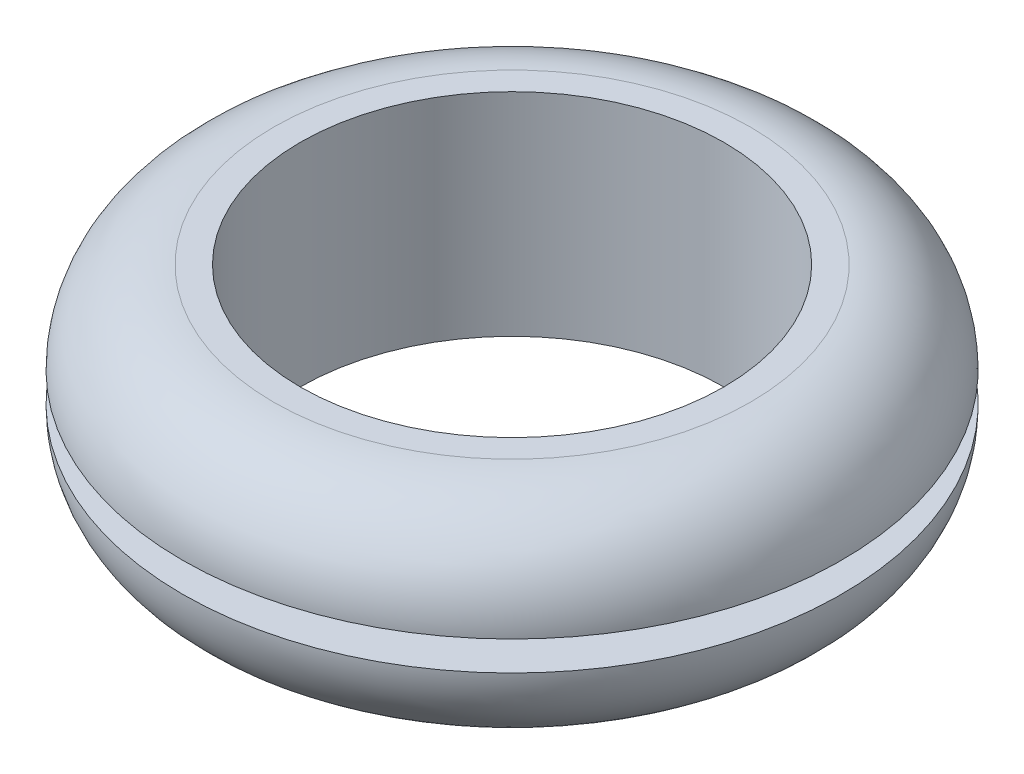
ISO-10303-21;
HEADER;
FILE_DESCRIPTION(('STEP AP214'),'2;1');
FILE_NAME('part.step','',(''),(''),'','','');
FILE_SCHEMA(('AUTOMOTIVE_DESIGN { 1 0 10303 214 1 1 1 1 }'));
ENDSEC;
DATA;
#1=APPLICATION_CONTEXT('core data for automotive mechanical design processes');
#2=APPLICATION_PROTOCOL_DEFINITION('international standard','automotive_design',2000,#1);
#3=PRODUCT_CONTEXT('',#1,'mechanical');
#4=PRODUCT('Part','Part','',(#3));
#5=PRODUCT_RELATED_PRODUCT_CATEGORY('part','',(#4));
#6=PRODUCT_DEFINITION_FORMATION('','',#4);
#7=PRODUCT_DEFINITION_CONTEXT('part definition',#1,'design');
#8=PRODUCT_DEFINITION('design','',#6,#7);
#9=PRODUCT_DEFINITION_SHAPE('','',#8);
#10=(LENGTH_UNIT() NAMED_UNIT(*) SI_UNIT(.MILLI.,.METRE.));
#11=(NAMED_UNIT(*) PLANE_ANGLE_UNIT() SI_UNIT($,.RADIAN.));
#12=(NAMED_UNIT(*) SI_UNIT($,.STERADIAN.) SOLID_ANGLE_UNIT());
#13=UNCERTAINTY_MEASURE_WITH_UNIT(LENGTH_MEASURE(1.E-05),#10,'distance_accuracy_value','');
#14=(GEOMETRIC_REPRESENTATION_CONTEXT(3) GLOBAL_UNCERTAINTY_ASSIGNED_CONTEXT((#13)) GLOBAL_UNIT_ASSIGNED_CONTEXT((#10,
#11,#12)) REPRESENTATION_CONTEXT('',''));
#15=CARTESIAN_POINT('',(0.,0.,0.));
#16=DIRECTION('',(0.,0.,1.));
#17=DIRECTION('',(1.,0.,0.));
#18=AXIS2_PLACEMENT_3D('',#15,#16,#17);
#19=CARTESIAN_POINT('',(0.,9.,0.));
#20=DIRECTION('',(0.,1.,0.));
#21=DIRECTION('',(0.,0.,1.));
#22=AXIS2_PLACEMENT_3D('',#19,#20,#21);
#23=PLANE('',#22);
#24=CARTESIAN_POINT('',(0.,9.,0.));
#25=DIRECTION('',(0.,1.,0.));
#26=DIRECTION('',(0.,0.,1.));
#27=AXIS2_PLACEMENT_3D('',#24,#25,#26);
#28=CIRCLE('',#27,10.125);
#29=CARTESIAN_POINT('',(0.,9.,10.125));
#30=VERTEX_POINT('',#29);
#31=EDGE_CURVE('E10',#30,#30,#28,.T.);
#32=ORIENTED_EDGE('',*,*,#31,.T.);
#33=EDGE_LOOP('',(#32));
#34=FACE_BOUND('',#33,.T.);
#35=CARTESIAN_POINT('',(0.,9.,0.));
#36=DIRECTION('',(0.,1.,0.));
#37=DIRECTION('',(0.,0.,1.));
#38=AXIS2_PLACEMENT_3D('',#35,#36,#37);
#39=CIRCLE('',#38,9.00000000000001);
#40=CARTESIAN_POINT('',(0.,9.,9.00000000000001));
#41=VERTEX_POINT('',#40);
#42=EDGE_CURVE('E45',#41,#41,#39,.T.);
#43=ORIENTED_EDGE('',*,*,#42,.F.);
#44=EDGE_LOOP('',(#43));
#45=FACE_BOUND('',#44,.T.);
#46=ADVANCED_FACE('F34',(#34,#45),#23,.T.);
#47=CARTESIAN_POINT('',(0.,0.,0.));
#48=DIRECTION('',(0.,1.,0.));
#49=DIRECTION('',(0.,0.,1.));
#50=AXIS2_PLACEMENT_3D('',#47,#48,#49);
#51=PLANE('',#50);
#52=CARTESIAN_POINT('',(0.,0.,0.));
#53=DIRECTION('',(0.,1.,0.));
#54=DIRECTION('',(0.,0.,1.));
#55=AXIS2_PLACEMENT_3D('',#52,#53,#54);
#56=CIRCLE('',#55,10.125);
#57=CARTESIAN_POINT('',(0.,0.,10.125));
#58=VERTEX_POINT('',#57);
#59=EDGE_CURVE('E41',#58,#58,#56,.F.);
#60=ORIENTED_EDGE('',*,*,#59,.T.);
#61=EDGE_LOOP('',(#60));
#62=FACE_BOUND('',#61,.T.);
#63=CARTESIAN_POINT('',(0.,0.,0.));
#64=DIRECTION('',(0.,1.,0.));
#65=DIRECTION('',(0.,0.,1.));
#66=AXIS2_PLACEMENT_3D('',#63,#64,#65);
#67=CIRCLE('',#66,9.00000000000001);
#68=CARTESIAN_POINT('',(0.,0.,9.00000000000001));
#69=VERTEX_POINT('',#68);
#70=EDGE_CURVE('E49',#69,#69,#67,.T.);
#71=ORIENTED_EDGE('',*,*,#70,.T.);
#72=EDGE_LOOP('',(#71));
#73=FACE_BOUND('',#72,.T.);
#74=ADVANCED_FACE('F86',(#62,#73),#51,.F.);
#75=CARTESIAN_POINT('',(0.,9.,0.));
#76=DIRECTION('',(0.,-1.,0.));
#77=DIRECTION('',(0.,0.,-1.));
#78=AXIS2_PLACEMENT_3D('',#75,#76,#77);
#79=CYLINDRICAL_SURFACE('',#78,9.00000000000001);
#80=ORIENTED_EDGE('',*,*,#42,.T.);
#81=EDGE_LOOP('',(#80));
#82=FACE_BOUND('',#81,.T.);
#83=ORIENTED_EDGE('',*,*,#70,.F.);
#84=EDGE_LOOP('',(#83));
#85=FACE_BOUND('',#84,.T.);
#86=ADVANCED_FACE('F91',(#82,#85),#79,.F.);
#87=CARTESIAN_POINT('',(0.,3.875,0.));
#88=DIRECTION('',(0.,1.,0.));
#89=DIRECTION('',(0.,0.,1.));
#90=AXIS2_PLACEMENT_3D('',#87,#88,#89);
#91=TOROIDAL_SURFACE('',#90,10.125,3.875);
#92=ORIENTED_EDGE('',*,*,#59,.F.);
#93=EDGE_LOOP('',(#92));
#94=FACE_BOUND('',#93,.T.);
#95=CARTESIAN_POINT('',(0.,3.875,0.));
#96=DIRECTION('',(0.,1.,0.));
#97=DIRECTION('',(0.,0.,1.));
#98=AXIS2_PLACEMENT_3D('',#95,#96,#97);
#99=CIRCLE('',#98,14.);
#100=CARTESIAN_POINT('',(0.,3.875,14.));
#101=VERTEX_POINT('',#100);
#102=EDGE_CURVE('E53',#101,#101,#99,.F.);
#103=ORIENTED_EDGE('',*,*,#102,.T.);
#104=EDGE_LOOP('',(#103));
#105=FACE_BOUND('',#104,.T.);
#106=ADVANCED_FACE('F81',(#94,#105),#91,.T.);
#107=CARTESIAN_POINT('',(0.,5.125,0.));
#108=DIRECTION('',(0.,1.,0.));
#109=DIRECTION('',(0.,0.,1.));
#110=AXIS2_PLACEMENT_3D('',#107,#108,#109);
#111=TOROIDAL_SURFACE('',#110,10.125,3.875);
#112=CARTESIAN_POINT('',(0.,5.125,0.));
#113=DIRECTION('',(0.,1.,0.));
#114=DIRECTION('',(0.,0.,1.));
#115=AXIS2_PLACEMENT_3D('',#112,#113,#114);
#116=CIRCLE('',#115,14.);
#117=CARTESIAN_POINT('',(0.,5.125,14.));
#118=VERTEX_POINT('',#117);
#119=EDGE_CURVE('E57',#118,#118,#116,.F.);
#120=ORIENTED_EDGE('',*,*,#119,.F.);
#121=EDGE_LOOP('',(#120));
#122=FACE_BOUND('',#121,.T.);
#123=ORIENTED_EDGE('',*,*,#31,.F.);
#124=EDGE_LOOP('',(#123));
#125=FACE_BOUND('',#124,.T.);
#126=ADVANCED_FACE('F36',(#122,#125),#111,.T.);
#127=CARTESIAN_POINT('',(0.,3.875,0.));
#128=DIRECTION('',(0.,1.,0.));
#129=DIRECTION('',(0.,0.,1.));
#130=AXIS2_PLACEMENT_3D('',#127,#128,#129);
#131=PLANE('',#130);
#132=ORIENTED_EDGE('',*,*,#102,.F.);
#133=EDGE_LOOP('',(#132));
#134=FACE_BOUND('',#133,.T.);
#135=CARTESIAN_POINT('',(0.,3.875,0.));
#136=DIRECTION('',(0.,1.,0.));
#137=DIRECTION('',(0.,0.,1.));
#138=AXIS2_PLACEMENT_3D('',#135,#136,#137);
#139=CIRCLE('',#138,11.);
#140=CARTESIAN_POINT('',(0.,3.875,11.));
#141=VERTEX_POINT('',#140);
#142=EDGE_CURVE('E60',#141,#141,#139,.T.);
#143=ORIENTED_EDGE('',*,*,#142,.F.);
#144=EDGE_LOOP('',(#143));
#145=FACE_BOUND('',#144,.T.);
#146=ADVANCED_FACE('F70',(#134,#145),#131,.T.);
#147=CARTESIAN_POINT('',(0.,5.125,0.));
#148=DIRECTION('',(0.,1.,0.));
#149=DIRECTION('',(0.,0.,1.));
#150=AXIS2_PLACEMENT_3D('',#147,#148,#149);
#151=PLANE('',#150);
#152=ORIENTED_EDGE('',*,*,#119,.T.);
#153=EDGE_LOOP('',(#152));
#154=FACE_BOUND('',#153,.T.);
#155=CARTESIAN_POINT('',(0.,5.125,0.));
#156=DIRECTION('',(0.,1.,0.));
#157=DIRECTION('',(0.,0.,1.));
#158=AXIS2_PLACEMENT_3D('',#155,#156,#157);
#159=CIRCLE('',#158,11.);
#160=CARTESIAN_POINT('',(0.,5.125,11.));
#161=VERTEX_POINT('',#160);
#162=EDGE_CURVE('E61',#161,#161,#159,.T.);
#163=ORIENTED_EDGE('',*,*,#162,.T.);
#164=EDGE_LOOP('',(#163));
#165=FACE_BOUND('',#164,.T.);
#166=ADVANCED_FACE('F72',(#154,#165),#151,.F.);
#167=CARTESIAN_POINT('',(0.,3.875,0.));
#168=DIRECTION('',(0.,1.,0.));
#169=DIRECTION('',(0.,0.,1.));
#170=AXIS2_PLACEMENT_3D('',#167,#168,#169);
#171=CYLINDRICAL_SURFACE('',#170,11.);
#172=ORIENTED_EDGE('',*,*,#142,.T.);
#173=EDGE_LOOP('',(#172));
#174=FACE_BOUND('',#173,.T.);
#175=ORIENTED_EDGE('',*,*,#162,.F.);
#176=EDGE_LOOP('',(#175));
#177=FACE_BOUND('',#176,.T.);
#178=ADVANCED_FACE('F67',(#174,#177),#171,.T.);
#179=CLOSED_SHELL('',(#46,#74,#86,#106,#126,#146,#166,#178));
#180=MANIFOLD_SOLID_BREP('B2',#179);
#181=ADVANCED_BREP_SHAPE_REPRESENTATION('',(#18,#180),#14);
#182=SHAPE_DEFINITION_REPRESENTATION(#9,#181);
ENDSEC;
END-ISO-10303-21;
